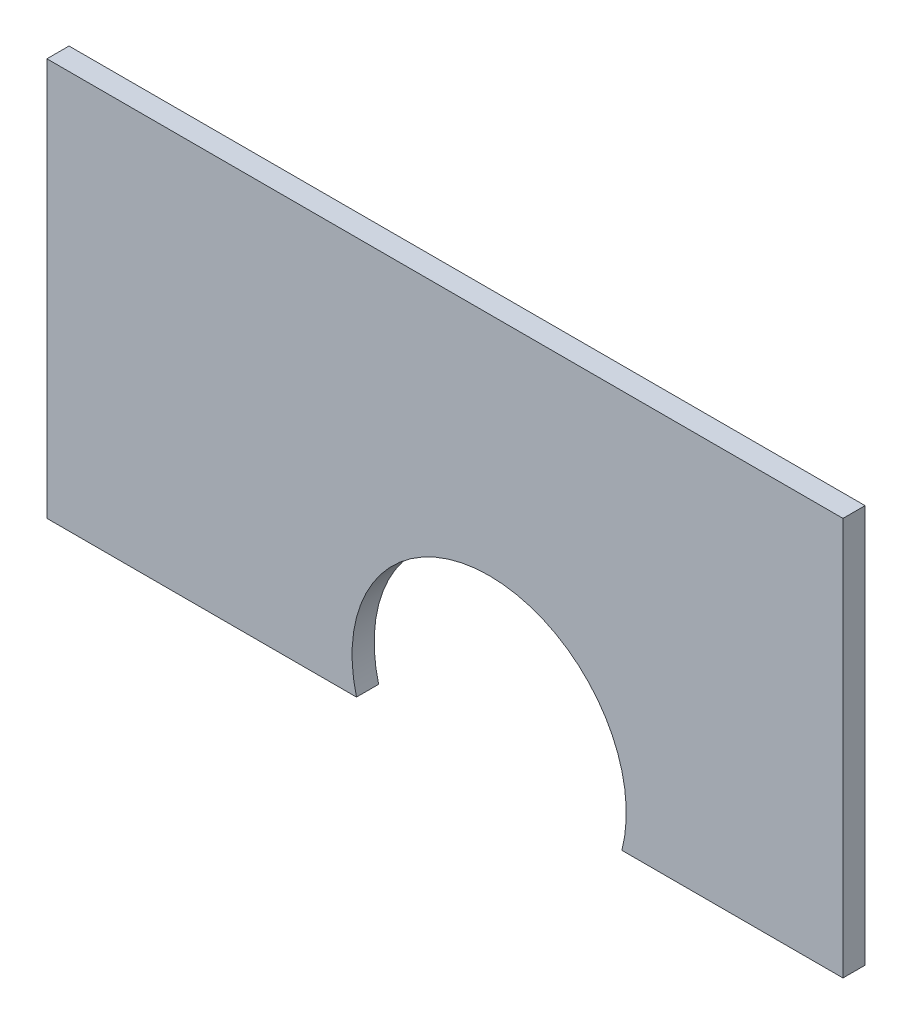
ISO-10303-21;
HEADER;
FILE_DESCRIPTION(('STEP AP214'),'2;1');
FILE_NAME('part.step','',(''),(''),'','','');
FILE_SCHEMA(('AUTOMOTIVE_DESIGN { 1 0 10303 214 1 1 1 1 }'));
ENDSEC;
DATA;
#1=APPLICATION_CONTEXT('core data for automotive mechanical design processes');
#2=APPLICATION_PROTOCOL_DEFINITION('international standard','automotive_design',2000,#1);
#3=PRODUCT_CONTEXT('',#1,'mechanical');
#4=PRODUCT('Part','Part','',(#3));
#5=PRODUCT_RELATED_PRODUCT_CATEGORY('part','',(#4));
#6=PRODUCT_DEFINITION_FORMATION('','',#4);
#7=PRODUCT_DEFINITION_CONTEXT('part definition',#1,'design');
#8=PRODUCT_DEFINITION('design','',#6,#7);
#9=PRODUCT_DEFINITION_SHAPE('','',#8);
#10=(LENGTH_UNIT() NAMED_UNIT(*) SI_UNIT(.MILLI.,.METRE.));
#11=(NAMED_UNIT(*) PLANE_ANGLE_UNIT() SI_UNIT($,.RADIAN.));
#12=(NAMED_UNIT(*) SI_UNIT($,.STERADIAN.) SOLID_ANGLE_UNIT());
#13=UNCERTAINTY_MEASURE_WITH_UNIT(LENGTH_MEASURE(1.E-05),#10,'distance_accuracy_value','');
#14=(GEOMETRIC_REPRESENTATION_CONTEXT(3) GLOBAL_UNCERTAINTY_ASSIGNED_CONTEXT((#13)) GLOBAL_UNIT_ASSIGNED_CONTEXT((#10,
#11,#12)) REPRESENTATION_CONTEXT('',''));
#15=CARTESIAN_POINT('',(0.,0.,0.));
#16=DIRECTION('',(0.,0.,1.));
#17=DIRECTION('',(1.,0.,0.));
#18=AXIS2_PLACEMENT_3D('',#15,#16,#17);
#19=CARTESIAN_POINT('',(-200.,164.379500648187,10.));
#20=DIRECTION('',(0.,-1.,0.));
#21=DIRECTION('',(1.,0.,0.));
#22=AXIS2_PLACEMENT_3D('',#19,#20,#21);
#23=PLANE('',#22);
#24=DIRECTION('',(-1.,0.,0.));
#25=VECTOR('',#24,1.);
#26=CARTESIAN_POINT('',(-200.,164.379500648187,0.));
#27=LINE('',#26,#25);
#28=CARTESIAN_POINT('',(160.,164.379500648187,0.));
#29=VERTEX_POINT('',#28);
#30=CARTESIAN_POINT('',(-200.,164.379500648187,0.));
#31=VERTEX_POINT('',#30);
#32=EDGE_CURVE('E117',#29,#31,#27,.T.);
#33=ORIENTED_EDGE('',*,*,#32,.T.);
#34=DIRECTION('',(0.,0.,-1.));
#35=VECTOR('',#34,1.);
#36=CARTESIAN_POINT('',(-200.,164.379500648187,10.));
#37=LINE('',#36,#35);
#38=CARTESIAN_POINT('',(-200.,164.379500648187,10.));
#39=VERTEX_POINT('',#38);
#40=EDGE_CURVE('E11',#39,#31,#37,.T.);
#41=ORIENTED_EDGE('',*,*,#40,.F.);
#42=DIRECTION('',(-1.,0.,0.));
#43=VECTOR('',#42,1.);
#44=CARTESIAN_POINT('',(-200.,164.379500648187,10.));
#45=LINE('',#44,#43);
#46=CARTESIAN_POINT('',(160.,164.379500648187,10.));
#47=VERTEX_POINT('',#46);
#48=EDGE_CURVE('E127',#47,#39,#45,.T.);
#49=ORIENTED_EDGE('',*,*,#48,.F.);
#50=DIRECTION('',(0.,0.,-1.));
#51=VECTOR('',#50,1.);
#52=CARTESIAN_POINT('',(160.,164.379500648187,10.));
#53=LINE('',#52,#51);
#54=EDGE_CURVE('E113',#47,#29,#53,.T.);
#55=ORIENTED_EDGE('',*,*,#54,.T.);
#56=EDGE_LOOP('',(#33,#41,#49,#55));
#57=FACE_BOUND('',#56,.T.);
#58=ADVANCED_FACE('F33',(#57),#23,.F.);
#59=CARTESIAN_POINT('',(-200.,164.379500648187,10.));
#60=DIRECTION('',(1.,0.,0.));
#61=DIRECTION('',(0.,1.,0.));
#62=AXIS2_PLACEMENT_3D('',#59,#60,#61);
#63=PLANE('',#62);
#64=DIRECTION('',(0.,-1.,0.));
#65=VECTOR('',#64,1.);
#66=CARTESIAN_POINT('',(-200.,164.379500648187,0.));
#67=LINE('',#66,#65);
#68=CARTESIAN_POINT('',(-200.,-15.6204993518133,0.));
#69=VERTEX_POINT('',#68);
#70=EDGE_CURVE('E120',#31,#69,#67,.T.);
#71=ORIENTED_EDGE('',*,*,#70,.T.);
#72=DIRECTION('',(0.,0.,-1.));
#73=VECTOR('',#72,1.);
#74=CARTESIAN_POINT('',(-200.,-15.6204993518133,10.));
#75=LINE('',#74,#73);
#76=CARTESIAN_POINT('',(-200.,-15.6204993518133,10.));
#77=VERTEX_POINT('',#76);
#78=EDGE_CURVE('E41',#77,#69,#75,.T.);
#79=ORIENTED_EDGE('',*,*,#78,.F.);
#80=DIRECTION('',(0.,-1.,0.));
#81=VECTOR('',#80,1.);
#82=CARTESIAN_POINT('',(-200.,164.379500648187,10.));
#83=LINE('',#82,#81);
#84=EDGE_CURVE('E86',#39,#77,#83,.T.);
#85=ORIENTED_EDGE('',*,*,#84,.F.);
#86=ORIENTED_EDGE('',*,*,#40,.T.);
#87=EDGE_LOOP('',(#71,#79,#85,#86));
#88=FACE_BOUND('',#87,.T.);
#89=ADVANCED_FACE('F151',(#88),#63,.F.);
#90=CARTESIAN_POINT('',(-60.,-15.6204993518133,10.));
#91=DIRECTION('',(0.,1.,0.));
#92=DIRECTION('',(-1.,0.,0.));
#93=AXIS2_PLACEMENT_3D('',#90,#91,#92);
#94=PLANE('',#93);
#95=DIRECTION('',(1.,0.,0.));
#96=VECTOR('',#95,1.);
#97=CARTESIAN_POINT('',(-60.,-15.6204993518133,0.));
#98=LINE('',#97,#96);
#99=CARTESIAN_POINT('',(-60.,-15.6204993518133,0.));
#100=VERTEX_POINT('',#99);
#101=EDGE_CURVE('E122',#69,#100,#98,.T.);
#102=ORIENTED_EDGE('',*,*,#101,.T.);
#103=DIRECTION('',(0.,0.,-1.));
#104=VECTOR('',#103,1.);
#105=CARTESIAN_POINT('',(-60.,-15.6204993518133,10.));
#106=LINE('',#105,#104);
#107=CARTESIAN_POINT('',(-60.,-15.6204993518133,10.));
#108=VERTEX_POINT('',#107);
#109=EDGE_CURVE('E108',#108,#100,#106,.T.);
#110=ORIENTED_EDGE('',*,*,#109,.F.);
#111=DIRECTION('',(1.,0.,0.));
#112=VECTOR('',#111,1.);
#113=CARTESIAN_POINT('',(-60.,-15.6204993518133,10.));
#114=LINE('',#113,#112);
#115=EDGE_CURVE('E99',#77,#108,#114,.T.);
#116=ORIENTED_EDGE('',*,*,#115,.F.);
#117=ORIENTED_EDGE('',*,*,#78,.T.);
#118=EDGE_LOOP('',(#102,#110,#116,#117));
#119=FACE_BOUND('',#118,.T.);
#120=ADVANCED_FACE('F133',(#119),#94,.F.);
#121=CARTESIAN_POINT('',(0.,0.,10.));
#122=DIRECTION('',(0.,0.,-1.));
#123=DIRECTION('',(-1.,0.,0.));
#124=AXIS2_PLACEMENT_3D('',#121,#122,#123);
#125=CYLINDRICAL_SURFACE('',#124,62.);
#126=CARTESIAN_POINT('',(0.,0.,0.));
#127=DIRECTION('',(0.,0.,-1.));
#128=DIRECTION('',(1.,0.,0.));
#129=AXIS2_PLACEMENT_3D('',#126,#127,#128);
#130=CIRCLE('',#129,62.);
#131=CARTESIAN_POINT('',(60.,-15.6204993518133,0.));
#132=VERTEX_POINT('',#131);
#133=EDGE_CURVE('E107',#100,#132,#130,.T.);
#134=ORIENTED_EDGE('',*,*,#133,.T.);
#135=DIRECTION('',(0.,0.,-1.));
#136=VECTOR('',#135,1.);
#137=CARTESIAN_POINT('',(60.,-15.6204993518133,10.));
#138=LINE('',#137,#136);
#139=CARTESIAN_POINT('',(60.,-15.6204993518133,10.));
#140=VERTEX_POINT('',#139);
#141=EDGE_CURVE('E104',#140,#132,#138,.T.);
#142=ORIENTED_EDGE('',*,*,#141,.F.);
#143=CARTESIAN_POINT('',(0.,0.,10.));
#144=DIRECTION('',(0.,0.,-1.));
#145=DIRECTION('',(1.,0.,0.));
#146=AXIS2_PLACEMENT_3D('',#143,#144,#145);
#147=CIRCLE('',#146,62.);
#148=EDGE_CURVE('E93',#108,#140,#147,.T.);
#149=ORIENTED_EDGE('',*,*,#148,.F.);
#150=ORIENTED_EDGE('',*,*,#109,.T.);
#151=EDGE_LOOP('',(#134,#142,#149,#150));
#152=FACE_BOUND('',#151,.T.);
#153=ADVANCED_FACE('F105',(#152),#125,.F.);
#154=CARTESIAN_POINT('',(60.,-15.6204993518133,10.));
#155=DIRECTION('',(0.,1.,0.));
#156=DIRECTION('',(0.,0.,1.));
#157=AXIS2_PLACEMENT_3D('',#154,#155,#156);
#158=PLANE('',#157);
#159=DIRECTION('',(1.,0.,0.));
#160=VECTOR('',#159,1.);
#161=CARTESIAN_POINT('',(60.,-15.6204993518133,0.));
#162=LINE('',#161,#160);
#163=CARTESIAN_POINT('',(160.,-15.6204993518133,0.));
#164=VERTEX_POINT('',#163);
#165=EDGE_CURVE('E72',#132,#164,#162,.T.);
#166=ORIENTED_EDGE('',*,*,#165,.T.);
#167=DIRECTION('',(0.,0.,-1.));
#168=VECTOR('',#167,1.);
#169=CARTESIAN_POINT('',(160.,-15.6204993518133,10.));
#170=LINE('',#169,#168);
#171=CARTESIAN_POINT('',(160.,-15.6204993518133,10.));
#172=VERTEX_POINT('',#171);
#173=EDGE_CURVE('E109',#172,#164,#170,.T.);
#174=ORIENTED_EDGE('',*,*,#173,.F.);
#175=DIRECTION('',(1.,0.,0.));
#176=VECTOR('',#175,1.);
#177=CARTESIAN_POINT('',(60.,-15.6204993518133,10.));
#178=LINE('',#177,#176);
#179=EDGE_CURVE('E97',#140,#172,#178,.T.);
#180=ORIENTED_EDGE('',*,*,#179,.F.);
#181=ORIENTED_EDGE('',*,*,#141,.T.);
#182=EDGE_LOOP('',(#166,#174,#180,#181));
#183=FACE_BOUND('',#182,.T.);
#184=ADVANCED_FACE('F111',(#183),#158,.F.);
#185=CARTESIAN_POINT('',(160.,164.379500648187,10.));
#186=DIRECTION('',(-1.,0.,0.));
#187=DIRECTION('',(0.,-1.,0.));
#188=AXIS2_PLACEMENT_3D('',#185,#186,#187);
#189=PLANE('',#188);
#190=DIRECTION('',(0.,1.,0.));
#191=VECTOR('',#190,1.);
#192=CARTESIAN_POINT('',(160.,164.379500648187,0.));
#193=LINE('',#192,#191);
#194=EDGE_CURVE('E78',#164,#29,#193,.T.);
#195=ORIENTED_EDGE('',*,*,#194,.T.);
#196=ORIENTED_EDGE('',*,*,#54,.F.);
#197=DIRECTION('',(0.,1.,0.));
#198=VECTOR('',#197,1.);
#199=CARTESIAN_POINT('',(160.,164.379500648187,10.));
#200=LINE('',#199,#198);
#201=EDGE_CURVE('E49',#172,#47,#200,.T.);
#202=ORIENTED_EDGE('',*,*,#201,.F.);
#203=ORIENTED_EDGE('',*,*,#173,.T.);
#204=EDGE_LOOP('',(#195,#196,#202,#203));
#205=FACE_BOUND('',#204,.T.);
#206=ADVANCED_FACE('F140',(#205),#189,.F.);
#207=CARTESIAN_POINT('',(0.,0.,10.));
#208=DIRECTION('',(0.,0.,1.));
#209=DIRECTION('',(1.,0.,0.));
#210=AXIS2_PLACEMENT_3D('',#207,#208,#209);
#211=PLANE('',#210);
#212=ORIENTED_EDGE('',*,*,#48,.T.);
#213=ORIENTED_EDGE('',*,*,#84,.T.);
#214=ORIENTED_EDGE('',*,*,#115,.T.);
#215=ORIENTED_EDGE('',*,*,#148,.T.);
#216=ORIENTED_EDGE('',*,*,#179,.T.);
#217=ORIENTED_EDGE('',*,*,#201,.T.);
#218=EDGE_LOOP('',(#212,#213,#214,#215,#216,#217));
#219=FACE_BOUND('',#218,.T.);
#220=ADVANCED_FACE('F95',(#219),#211,.T.);
#221=CARTESIAN_POINT('',(0.,0.,0.));
#222=DIRECTION('',(0.,0.,1.));
#223=DIRECTION('',(1.,0.,0.));
#224=AXIS2_PLACEMENT_3D('',#221,#222,#223);
#225=PLANE('',#224);
#226=ORIENTED_EDGE('',*,*,#32,.F.);
#227=ORIENTED_EDGE('',*,*,#194,.F.);
#228=ORIENTED_EDGE('',*,*,#165,.F.);
#229=ORIENTED_EDGE('',*,*,#133,.F.);
#230=ORIENTED_EDGE('',*,*,#101,.F.);
#231=ORIENTED_EDGE('',*,*,#70,.F.);
#232=EDGE_LOOP('',(#226,#227,#228,#229,#230,#231));
#233=FACE_BOUND('',#232,.T.);
#234=ADVANCED_FACE('F136',(#233),#225,.F.);
#235=CLOSED_SHELL('',(#58,#89,#120,#153,#184,#206,#220,#234));
#236=MANIFOLD_SOLID_BREP('B2',#235);
#237=ADVANCED_BREP_SHAPE_REPRESENTATION('',(#18,#236),#14);
#238=SHAPE_DEFINITION_REPRESENTATION(#9,#237);
ENDSEC;
END-ISO-10303-21;
